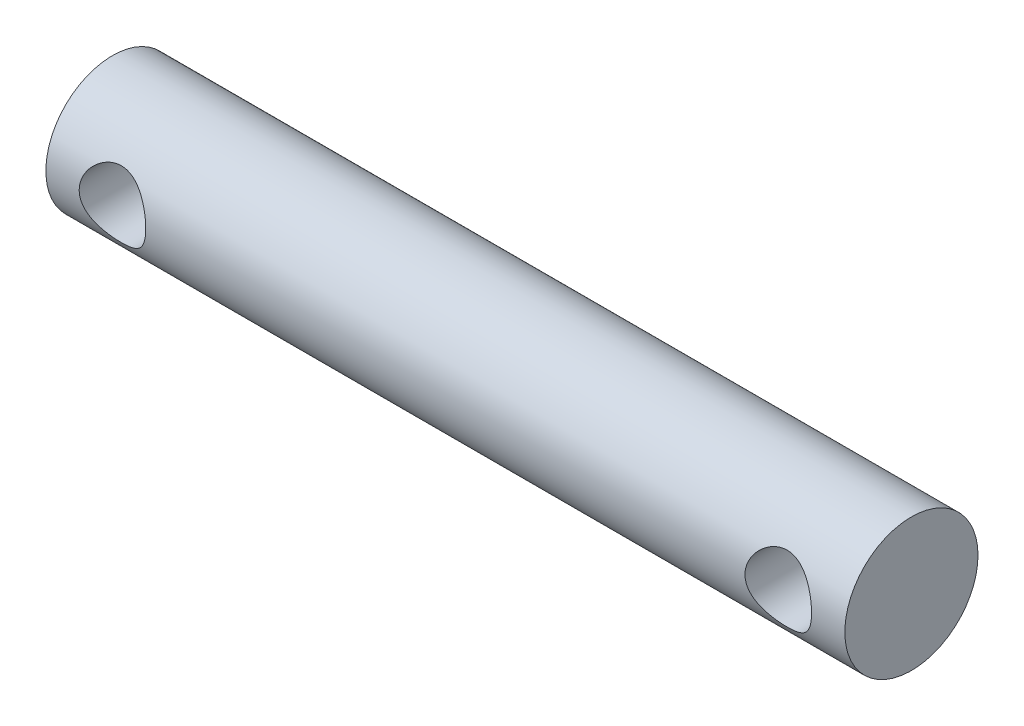
ISO-10303-21;
HEADER;
FILE_DESCRIPTION(('STEP AP214'),'2;1');
FILE_NAME('part.step','',(''),(''),'','','');
FILE_SCHEMA(('AUTOMOTIVE_DESIGN { 1 0 10303 214 1 1 1 1 }'));
ENDSEC;
DATA;
#1=APPLICATION_CONTEXT('core data for automotive mechanical design processes');
#2=APPLICATION_PROTOCOL_DEFINITION('international standard','automotive_design',2000,#1);
#3=PRODUCT_CONTEXT('',#1,'mechanical');
#4=PRODUCT('Part','Part','',(#3));
#5=PRODUCT_RELATED_PRODUCT_CATEGORY('part','',(#4));
#6=PRODUCT_DEFINITION_FORMATION('','',#4);
#7=PRODUCT_DEFINITION_CONTEXT('part definition',#1,'design');
#8=PRODUCT_DEFINITION('design','',#6,#7);
#9=PRODUCT_DEFINITION_SHAPE('','',#8);
#10=(LENGTH_UNIT() NAMED_UNIT(*) SI_UNIT(.MILLI.,.METRE.));
#11=(NAMED_UNIT(*) PLANE_ANGLE_UNIT() SI_UNIT($,.RADIAN.));
#12=(NAMED_UNIT(*) SI_UNIT($,.STERADIAN.) SOLID_ANGLE_UNIT());
#13=UNCERTAINTY_MEASURE_WITH_UNIT(LENGTH_MEASURE(1.E-05),#10,'distance_accuracy_value','');
#14=(GEOMETRIC_REPRESENTATION_CONTEXT(3) GLOBAL_UNCERTAINTY_ASSIGNED_CONTEXT((#13)) GLOBAL_UNIT_ASSIGNED_CONTEXT((#10,
#11,#12)) REPRESENTATION_CONTEXT('',''));
#15=CARTESIAN_POINT('',(0.,0.,0.));
#16=DIRECTION('',(0.,0.,1.));
#17=DIRECTION('',(1.,0.,0.));
#18=AXIS2_PLACEMENT_3D('',#15,#16,#17);
#19=CARTESIAN_POINT('',(36.,0.,0.));
#20=DIRECTION('',(-1.,0.,0.));
#21=DIRECTION('',(0.,0.,1.));
#22=AXIS2_PLACEMENT_3D('',#19,#20,#21);
#23=CYLINDRICAL_SURFACE('',#22,3.);
#24=CARTESIAN_POINT('',(4.5,0.,-3.));
#25=CARTESIAN_POINT('',(4.49999504652421,0.0788579444268501,-2.99999570107562));
#26=CARTESIAN_POINT('',(4.49374489031842,0.157809899546344,-2.99685736529635));
#27=CARTESIAN_POINT('',(4.46902067948769,0.313380352903344,-2.98461234055736));
#28=CARTESIAN_POINT('',(4.45052341050328,0.389994130070444,-2.97549431743379));
#29=CARTESIAN_POINT('',(4.40220928707506,0.538400317320673,-2.95224419105063));
#30=CARTESIAN_POINT('',(4.37243642362805,0.610210204408719,-2.93813158766306));
#31=CARTESIAN_POINT('',(4.30264406795253,0.747708925209898,-2.90618664773642));
#32=CARTESIAN_POINT('',(4.26262538362671,0.813398240985088,-2.88835460450288));
#33=CARTESIAN_POINT('',(4.17072412577207,0.941261726642863,-2.84934387387093));
#34=CARTESIAN_POINT('',(4.11827028114054,1.00298281668316,-2.82802798691306));
#35=CARTESIAN_POINT('',(4.00421778112945,1.11716916730047,-2.78489955370115));
#36=CARTESIAN_POINT('',(3.94261222234134,1.16962737466015,-2.76308664313552));
#37=CARTESIAN_POINT('',(3.80627497571493,1.26787800067542,-2.71948426796021));
#38=CARTESIAN_POINT('',(3.73089585248113,1.31283800332745,-2.69782780455198));
#39=CARTESIAN_POINT('',(3.57244899602068,1.38925234033604,-2.65928968158481));
#40=CARTESIAN_POINT('',(3.48938680691588,1.4207163224495,-2.64240461410484));
#41=CARTESIAN_POINT('',(3.32300234186712,1.46719866328288,-2.61686800556713));
#42=CARTESIAN_POINT('',(3.23999332189891,1.48308878562066,-2.6077840737557));
#43=CARTESIAN_POINT('',(3.07203174333079,1.50064048996327,-2.59772834922792));
#44=CARTESIAN_POINT('',(2.98708118869327,1.50231613255961,-2.59674854014932));
#45=CARTESIAN_POINT('',(2.82857096352695,1.49203093075844,-2.60266395385873));
#46=CARTESIAN_POINT('',(2.75486395316543,1.48167683930523,-2.6086314549302));
#47=CARTESIAN_POINT('',(2.61041713594044,1.4504097735854,-2.62614343100776));
#48=CARTESIAN_POINT('',(2.53967828204203,1.42949343584648,-2.63768968247664));
#49=CARTESIAN_POINT('',(2.40115630115151,1.37731467057901,-2.66531214619112));
#50=CARTESIAN_POINT('',(2.33348040182132,1.34582260067399,-2.68148760995998));
#51=CARTESIAN_POINT('',(2.20404856111499,1.273562531502,-2.71655106422106));
#52=CARTESIAN_POINT('',(2.14229529659987,1.2327903657187,-2.73544027170286));
#53=CARTESIAN_POINT('',(2.01821812088516,1.13709908236918,-2.77669736854929));
#54=CARTESIAN_POINT('',(1.95681468963577,1.08104168755392,-2.79920265355119));
#55=CARTESIAN_POINT('',(1.84389687211365,0.95933336811206,-2.84321434950611));
#56=CARTESIAN_POINT('',(1.79238721194918,0.893677884861428,-2.86472027938201));
#57=CARTESIAN_POINT('',(1.69847150845541,0.750774758747772,-2.90552980924446));
#58=CARTESIAN_POINT('',(1.65659929133139,0.673130387399113,-2.92468476243011));
#59=CARTESIAN_POINT('',(1.58685445643549,0.510699323233195,-2.95736821681863));
#60=CARTESIAN_POINT('',(1.55897072247725,0.425918364397914,-2.9709011841533));
#61=CARTESIAN_POINT('',(1.52028689442499,0.259149737491053,-2.98986500612153));
#62=CARTESIAN_POINT('',(1.50826314637983,0.177512295822489,-2.99587407451965));
#63=CARTESIAN_POINT('',(1.49780290329827,0.0131693999240276,-3.00109520188655));
#64=CARTESIAN_POINT('',(1.4993599715408,-0.0695355298048629,-3.00031048081978));
#65=CARTESIAN_POINT('',(1.51531003262812,-0.22684945797898,-2.99236788380152));
#66=CARTESIAN_POINT('',(1.52869879909499,-0.301589112074895,-2.98570868532253));
#67=CARTESIAN_POINT('',(1.56635710784269,-0.447610338452911,-2.9673325697226));
#68=CARTESIAN_POINT('',(1.59062784968024,-0.51889152853663,-2.95561509501618));
#69=CARTESIAN_POINT('',(1.64999769964955,-0.658332912674358,-2.92776377120382));
#70=CARTESIAN_POINT('',(1.68538657517443,-0.726345595508704,-2.91151322654446));
#71=CARTESIAN_POINT('',(1.76566130346985,-0.855692042548907,-2.87615961476126));
#72=CARTESIAN_POINT('',(1.8105512018931,-0.917022944664887,-2.85705533350407));
#73=CARTESIAN_POINT('',(1.91364063799608,-1.03765153393382,-2.81562332004297));
#74=CARTESIAN_POINT('',(1.97271430266772,-1.09615811672854,-2.79316327265249));
#75=CARTESIAN_POINT('',(2.09988772691659,-1.20278448167828,-2.7489358741323));
#76=CARTESIAN_POINT('',(2.16799367827188,-1.25089707856781,-2.72716901100071));
#77=CARTESIAN_POINT('',(2.31546548125947,-1.33756187171853,-2.68576788309734));
#78=CARTESIAN_POINT('',(2.39521689914173,-1.37553824370037,-2.66628794383591));
#79=CARTESIAN_POINT('',(2.56126510136245,-1.43712423890206,-2.63361108441202));
#80=CARTESIAN_POINT('',(2.64755328970034,-1.46075237380052,-2.62040607332625));
#81=CARTESIAN_POINT('',(2.81536533432706,-1.49079253120031,-2.60342251538703));
#82=CARTESIAN_POINT('',(2.89655138015286,-1.49863949460818,-2.59886075197597));
#83=CARTESIAN_POINT('',(3.05917060074679,-1.5010337315643,-2.59748031962405));
#84=CARTESIAN_POINT('',(3.14060365310679,-1.49558676993486,-2.60065829439585));
#85=CARTESIAN_POINT('',(3.29322525230016,-1.47288918838996,-2.61356793076615));
#86=CARTESIAN_POINT('',(3.36465070521711,-1.45681247151455,-2.62264641723988));
#87=CARTESIAN_POINT('',(3.50371217913655,-1.41476303733662,-2.64556524281479));
#88=CARTESIAN_POINT('',(3.57134697313805,-1.38878713673988,-2.65940711354503));
#89=CARTESIAN_POINT('',(3.70593727647981,-1.32572361795085,-2.69142795546804));
#90=CARTESIAN_POINT('',(3.77254185274355,-1.28800670672355,-2.70983583593881));
#91=CARTESIAN_POINT('',(3.89891180427189,-1.20322645745609,-2.74852997452291));
#92=CARTESIAN_POINT('',(3.95867359578167,-1.15615825686234,-2.76881720693416));
#93=CARTESIAN_POINT('',(4.07721297353201,-1.04730498999206,-2.81193484737138));
#94=CARTESIAN_POINT('',(4.13498865352544,-0.984426634495891,-2.83477474959942));
#95=CARTESIAN_POINT('',(4.23939447515291,-0.849232209349795,-2.87816628389896));
#96=CARTESIAN_POINT('',(4.28601860920486,-0.776911084957795,-2.89871667939293));
#97=CARTESIAN_POINT('',(4.36685454406811,-0.623897395174418,-2.93547014349806));
#98=CARTESIAN_POINT('',(4.4009762538547,-0.543149255665095,-2.95164144740899));
#99=CARTESIAN_POINT('',(4.45471225163612,-0.37611315170713,-2.9775201194848));
#100=CARTESIAN_POINT('',(4.47436777020857,-0.28984169938365,-2.98724585044602));
#101=CARTESIAN_POINT('',(4.49084611662861,-0.168902919736342,-2.99543192870217));
#102=CARTESIAN_POINT('',(4.49427396129951,-0.135242819162347,-2.99714048010376));
#103=CARTESIAN_POINT('',(4.49885199827113,-0.0677275977076368,-2.99942545465223));
#104=CARTESIAN_POINT('',(4.50000212770531,-0.0338724714699424,-3.00000184655071));
#105=CARTESIAN_POINT('',(4.5,0.,-3.));
#106=B_SPLINE_CURVE_WITH_KNOTS('',3,(#24,#25,#26,#27,#28,#29,#30,#31,#32,#33,#34,#35,#36,#37,
#38,#39,#40,#41,#42,#43,#44,#45,#46,#47,#48,#49,#50,#51,#52,#53,#54,#55,#56,#57,#58,#59,#60,#61,
#62,#63,#64,#65,#66,#67,#68,#69,#70,#71,#72,#73,#74,#75,#76,#77,#78,#79,#80,#81,#82,#83,#84,#85,
#86,#87,#88,#89,#90,#91,#92,#93,#94,#95,#96,#97,#98,#99,#100,#101,#102,#103,#104,#105),
.UNSPECIFIED.,.T.,.F.,(4,2,2,2,2,2,2,2,2,2,2,2,2,2,2,2,2,2,2,2,2,2,2,2,2,2,2,2,2,2,2,2,2,2,2,2,
2,2,2,2,4),(0.,0.236436386130439,0.473322224563796,0.709293233238447,0.945245640872351,
1.19547263807713,1.44588935648105,1.71572589646129,1.98536921847421,2.23887018210344,
2.4921203599353,2.71508568613981,2.93812205888518,3.16635360252731,3.39468781890332,
3.65197412000818,3.90938301898029,4.17874533321661,4.44789325368419,4.69474935707018,
4.94148846767214,5.16910359759183,5.39674382446397,5.63089284041848,5.86514176122509,
6.12239415966628,6.37982382923147,6.64972023242588,6.91926767918176,7.16293961254569,
7.40650589797017,7.62686895373283,7.84730293182526,8.08254685170431,8.31791341715446,
8.58187864135757,8.84598575071868,9.1119602049529,9.37717362931723,9.47872920200875,
9.58028757766598),.UNSPECIFIED.);
#107=CARTESIAN_POINT('',(4.5,0.,-3.));
#108=VERTEX_POINT('',#107);
#109=EDGE_CURVE('E10',#108,#108,#106,.T.);
#110=ORIENTED_EDGE('',*,*,#109,.T.);
#111=EDGE_LOOP('',(#110));
#112=FACE_BOUND('',#111,.T.);
#113=CARTESIAN_POINT('',(4.5,0.,3.));
#114=CARTESIAN_POINT('',(4.4999950465242,-0.0788579444268506,2.99999570107562));
#115=CARTESIAN_POINT('',(4.49374489031841,-0.157809899546344,2.99685736529635));
#116=CARTESIAN_POINT('',(4.4690206794877,-0.313380352903345,2.98461234055736));
#117=CARTESIAN_POINT('',(4.45052341050328,-0.389994130070444,2.97549431743379));
#118=CARTESIAN_POINT('',(4.40220928707506,-0.538400317320673,2.95224419105063));
#119=CARTESIAN_POINT('',(4.37243642362805,-0.610210204408719,2.93813158766306));
#120=CARTESIAN_POINT('',(4.30264406795253,-0.747708925209898,2.90618664773642));
#121=CARTESIAN_POINT('',(4.26262538362671,-0.813398240985088,2.88835460450288));
#122=CARTESIAN_POINT('',(4.17072412577207,-0.941261726642863,2.84934387387093));
#123=CARTESIAN_POINT('',(4.11827028114054,-1.00298281668316,2.82802798691306));
#124=CARTESIAN_POINT('',(4.00421778112945,-1.11716916730047,2.78489955370115));
#125=CARTESIAN_POINT('',(3.94261222234134,-1.16962737466015,2.76308664313552));
#126=CARTESIAN_POINT('',(3.80627497571493,-1.26787800067542,2.71948426796021));
#127=CARTESIAN_POINT('',(3.73089585248113,-1.31283800332745,2.69782780455198));
#128=CARTESIAN_POINT('',(3.57244899602068,-1.38925234033604,2.65928968158481));
#129=CARTESIAN_POINT('',(3.48938680691588,-1.4207163224495,2.64240461410484));
#130=CARTESIAN_POINT('',(3.32300234186712,-1.46719866328288,2.61686800556713));
#131=CARTESIAN_POINT('',(3.23999332189891,-1.48308878562066,2.6077840737557));
#132=CARTESIAN_POINT('',(3.07203174333079,-1.50064048996327,2.59772834922792));
#133=CARTESIAN_POINT('',(2.98708118869327,-1.50231613255961,2.59674854014932));
#134=CARTESIAN_POINT('',(2.82857096352695,-1.49203093075844,2.60266395385873));
#135=CARTESIAN_POINT('',(2.75486395316543,-1.48167683930523,2.6086314549302));
#136=CARTESIAN_POINT('',(2.61041713594044,-1.4504097735854,2.62614343100775));
#137=CARTESIAN_POINT('',(2.53967828204203,-1.42949343584648,2.63768968247664));
#138=CARTESIAN_POINT('',(2.40115630115151,-1.37731467057901,2.66531214619112));
#139=CARTESIAN_POINT('',(2.33348040182132,-1.34582260067399,2.68148760995998));
#140=CARTESIAN_POINT('',(2.20404856111499,-1.273562531502,2.71655106422106));
#141=CARTESIAN_POINT('',(2.14229529659987,-1.2327903657187,2.73544027170286));
#142=CARTESIAN_POINT('',(2.01821812088516,-1.13709908236918,2.77669736854929));
#143=CARTESIAN_POINT('',(1.95681468963577,-1.08104168755392,2.79920265355119));
#144=CARTESIAN_POINT('',(1.84389687211365,-0.95933336811206,2.84321434950611));
#145=CARTESIAN_POINT('',(1.79238721194918,-0.893677884861428,2.86472027938201));
#146=CARTESIAN_POINT('',(1.69847150845541,-0.750774758747773,2.90552980924446));
#147=CARTESIAN_POINT('',(1.65659929133139,-0.673130387399114,2.92468476243011));
#148=CARTESIAN_POINT('',(1.58685445643549,-0.510699323233196,2.95736821681863));
#149=CARTESIAN_POINT('',(1.55897072247725,-0.425918364397915,2.9709011841533));
#150=CARTESIAN_POINT('',(1.52028689442499,-0.259149737491054,2.98986500612153));
#151=CARTESIAN_POINT('',(1.50826314637983,-0.17751229582249,2.99587407451965));
#152=CARTESIAN_POINT('',(1.49780290329827,-0.0131693999240284,3.00109520188655));
#153=CARTESIAN_POINT('',(1.4993599715408,0.0695355298048622,3.00031048081978));
#154=CARTESIAN_POINT('',(1.51531003262812,0.226849457978979,2.99236788380152));
#155=CARTESIAN_POINT('',(1.52869879909499,0.301589112074894,2.98570868532253));
#156=CARTESIAN_POINT('',(1.56635710784269,0.447610338452911,2.9673325697226));
#157=CARTESIAN_POINT('',(1.59062784968024,0.51889152853663,2.95561509501618));
#158=CARTESIAN_POINT('',(1.64999769964955,0.658332912674358,2.92776377120382));
#159=CARTESIAN_POINT('',(1.68538657517443,0.726345595508704,2.91151322654446));
#160=CARTESIAN_POINT('',(1.76566130346985,0.855692042548907,2.87615961476126));
#161=CARTESIAN_POINT('',(1.8105512018931,0.917022944664886,2.85705533350407));
#162=CARTESIAN_POINT('',(1.91364063799608,1.03765153393382,2.81562332004297));
#163=CARTESIAN_POINT('',(1.97271430266772,1.09615811672854,2.79316327265249));
#164=CARTESIAN_POINT('',(2.09988772691659,1.20278448167828,2.7489358741323));
#165=CARTESIAN_POINT('',(2.16799367827188,1.25089707856781,2.72716901100071));
#166=CARTESIAN_POINT('',(2.31546548125947,1.33756187171853,2.68576788309734));
#167=CARTESIAN_POINT('',(2.39521689914173,1.37553824370037,2.66628794383591));
#168=CARTESIAN_POINT('',(2.56126510136245,1.43712423890206,2.63361108441202));
#169=CARTESIAN_POINT('',(2.64755328970034,1.46075237380052,2.62040607332625));
#170=CARTESIAN_POINT('',(2.81536533432706,1.49079253120031,2.60342251538703));
#171=CARTESIAN_POINT('',(2.89655138015287,1.49863949460818,2.59886075197597));
#172=CARTESIAN_POINT('',(3.05917060074679,1.5010337315643,2.59748031962405));
#173=CARTESIAN_POINT('',(3.14060365310679,1.49558676993486,2.60065829439585));
#174=CARTESIAN_POINT('',(3.29322525230016,1.47288918838996,2.61356793076615));
#175=CARTESIAN_POINT('',(3.36465070521711,1.45681247151455,2.62264641723988));
#176=CARTESIAN_POINT('',(3.50371217913655,1.41476303733662,2.64556524281479));
#177=CARTESIAN_POINT('',(3.57134697313805,1.38878713673988,2.65940711354503));
#178=CARTESIAN_POINT('',(3.70593727647981,1.32572361795085,2.69142795546804));
#179=CARTESIAN_POINT('',(3.77254185274354,1.28800670672355,2.70983583593881));
#180=CARTESIAN_POINT('',(3.89891180427189,1.20322645745609,2.74852997452291));
#181=CARTESIAN_POINT('',(3.95867359578167,1.15615825686234,2.76881720693416));
#182=CARTESIAN_POINT('',(4.07721297353201,1.04730498999206,2.81193484737138));
#183=CARTESIAN_POINT('',(4.13498865352544,0.984426634495892,2.83477474959942));
#184=CARTESIAN_POINT('',(4.23939447515291,0.849232209349796,2.87816628389896));
#185=CARTESIAN_POINT('',(4.28601860920486,0.776911084957796,2.89871667939293));
#186=CARTESIAN_POINT('',(4.36685454406811,0.623897395174419,2.93547014349806));
#187=CARTESIAN_POINT('',(4.4009762538547,0.543149255665096,2.95164144740899));
#188=CARTESIAN_POINT('',(4.45471225163612,0.37611315170713,2.9775201194848));
#189=CARTESIAN_POINT('',(4.47436777020857,0.28984169938365,2.98724585044602));
#190=CARTESIAN_POINT('',(4.49084611662862,0.168902919736343,2.99543192870217));
#191=CARTESIAN_POINT('',(4.49427396129951,0.135242819162347,2.99714048010376));
#192=CARTESIAN_POINT('',(4.49885199827113,0.0677275977076372,2.99942545465223));
#193=CARTESIAN_POINT('',(4.50000212770531,0.0338724714699426,3.00000184655071));
#194=CARTESIAN_POINT('',(4.5,0.,3.));
#195=B_SPLINE_CURVE_WITH_KNOTS('',3,(#113,#114,#115,#116,#117,#118,#119,#120,#121,#122,#123,
#124,#125,#126,#127,#128,#129,#130,#131,#132,#133,#134,#135,#136,#137,#138,#139,#140,#141,#142,
#143,#144,#145,#146,#147,#148,#149,#150,#151,#152,#153,#154,#155,#156,#157,#158,#159,#160,#161,
#162,#163,#164,#165,#166,#167,#168,#169,#170,#171,#172,#173,#174,#175,#176,#177,#178,#179,#180,
#181,#182,#183,#184,#185,#186,#187,#188,#189,#190,#191,#192,#193,#194),.UNSPECIFIED.,.T.,.F.,(4,
2,2,2,2,2,2,2,2,2,2,2,2,2,2,2,2,2,2,2,2,2,2,2,2,2,2,2,2,2,2,2,2,2,2,2,2,2,2,2,4),(0.,
0.236436386130439,0.473322224563796,0.709293233238446,0.94524564087235,1.19547263807713,
1.44588935648105,1.71572589646129,1.98536921847421,2.23887018210344,2.4921203599353,
2.71508568613981,2.93812205888517,3.16635360252731,3.39468781890332,3.65197412000817,
3.90938301898029,4.17874533321661,4.44789325368419,4.69474935707018,4.94148846767214,
5.16910359759183,5.39674382446397,5.63089284041848,5.86514176122509,6.12239415966628,
6.37982382923147,6.64972023242588,6.91926767918176,7.16293961254569,7.40650589797017,
7.62686895373283,7.84730293182526,8.0825468517043,8.31791341715446,8.58187864135757,
8.84598575071868,9.1119602049529,9.37717362931723,9.47872920200875,9.58028757766599),.UNSPECIFIED.);
#196=CARTESIAN_POINT('',(4.5,0.,3.));
#197=VERTEX_POINT('',#196);
#198=EDGE_CURVE('E45',#197,#197,#195,.T.);
#199=ORIENTED_EDGE('',*,*,#198,.T.);
#200=EDGE_LOOP('',(#199));
#201=FACE_BOUND('',#200,.T.);
#202=CARTESIAN_POINT('',(34.5,0.,-3.));
#203=CARTESIAN_POINT('',(34.4999950465242,0.0788579444268505,-2.99999570107562));
#204=CARTESIAN_POINT('',(34.4937448903184,0.157809899546344,-2.99685736529635));
#205=CARTESIAN_POINT('',(34.4690206794877,0.313380352903345,-2.98461234055736));
#206=CARTESIAN_POINT('',(34.4505234105033,0.389994130070445,-2.97549431743379));
#207=CARTESIAN_POINT('',(34.4022092870751,0.538400317320674,-2.95224419105063));
#208=CARTESIAN_POINT('',(34.3724364236281,0.610210204408719,-2.93813158766306));
#209=CARTESIAN_POINT('',(34.3026440679525,0.747708925209898,-2.90618664773642));
#210=CARTESIAN_POINT('',(34.2626253836267,0.81339824098509,-2.88835460450288));
#211=CARTESIAN_POINT('',(34.1707241257721,0.941261726642864,-2.84934387387093));
#212=CARTESIAN_POINT('',(34.1182702811405,1.00298281668316,-2.82802798691306));
#213=CARTESIAN_POINT('',(34.0042177811294,1.11716916730047,-2.78489955370115));
#214=CARTESIAN_POINT('',(33.9426122223413,1.16962737466015,-2.76308664313552));
#215=CARTESIAN_POINT('',(33.8062749757149,1.26787800067542,-2.71948426796021));
#216=CARTESIAN_POINT('',(33.7308958524811,1.31283800332746,-2.69782780455198));
#217=CARTESIAN_POINT('',(33.5724489960207,1.38925234033605,-2.65928968158481));
#218=CARTESIAN_POINT('',(33.4893868069159,1.4207163224495,-2.64240461410484));
#219=CARTESIAN_POINT('',(33.3230023418671,1.46719866328289,-2.61686800556713));
#220=CARTESIAN_POINT('',(33.2399933218989,1.48308878562067,-2.6077840737557));
#221=CARTESIAN_POINT('',(33.0720317433308,1.50064048996327,-2.59772834922791));
#222=CARTESIAN_POINT('',(32.9870811886933,1.50231613255961,-2.59674854014932));
#223=CARTESIAN_POINT('',(32.828570963527,1.49203093075845,-2.60266395385873));
#224=CARTESIAN_POINT('',(32.7548639531654,1.48167683930524,-2.6086314549302));
#225=CARTESIAN_POINT('',(32.6104171359404,1.4504097735854,-2.62614343100775));
#226=CARTESIAN_POINT('',(32.539678282042,1.42949343584648,-2.63768968247664));
#227=CARTESIAN_POINT('',(32.4011563011515,1.37731467057901,-2.66531214619111));
#228=CARTESIAN_POINT('',(32.3334804018213,1.34582260067399,-2.68148760995998));
#229=CARTESIAN_POINT('',(32.204048561115,1.27356253150201,-2.71655106422105));
#230=CARTESIAN_POINT('',(32.1422952965999,1.23279036571871,-2.73544027170286));
#231=CARTESIAN_POINT('',(32.0182181208852,1.13709908236919,-2.77669736854928));
#232=CARTESIAN_POINT('',(31.9568146896358,1.08104168755393,-2.79920265355119));
#233=CARTESIAN_POINT('',(31.8438968721136,0.959333368112066,-2.84321434950611));
#234=CARTESIAN_POINT('',(31.7923872119492,0.893677884861434,-2.86472027938201));
#235=CARTESIAN_POINT('',(31.6984715084554,0.750774758747778,-2.90552980924446));
#236=CARTESIAN_POINT('',(31.6565992913314,0.673130387399117,-2.92468476243011));
#237=CARTESIAN_POINT('',(31.5868544564355,0.510699323233196,-2.95736821681863));
#238=CARTESIAN_POINT('',(31.5589707224773,0.425918364397915,-2.9709011841533));
#239=CARTESIAN_POINT('',(31.520286894425,0.259149737491054,-2.98986500612153));
#240=CARTESIAN_POINT('',(31.5082631463798,0.17751229582249,-2.99587407451965));
#241=CARTESIAN_POINT('',(31.4978029032983,0.0131693999240292,-3.00109520188655));
#242=CARTESIAN_POINT('',(31.4993599715408,-0.0695355298048607,-3.00031048081978));
#243=CARTESIAN_POINT('',(31.5153100326281,-0.226849457978979,-2.99236788380152));
#244=CARTESIAN_POINT('',(31.528698799095,-0.301589112074895,-2.98570868532252));
#245=CARTESIAN_POINT('',(31.5663571078427,-0.447610338452912,-2.9673325697226));
#246=CARTESIAN_POINT('',(31.5906278496802,-0.518891528536631,-2.95561509501618));
#247=CARTESIAN_POINT('',(31.6499976996495,-0.658332912674357,-2.92776377120382));
#248=CARTESIAN_POINT('',(31.6853865751744,-0.7263455955087,-2.91151322654446));
#249=CARTESIAN_POINT('',(31.7656613034698,-0.855692042548903,-2.87615961476127));
#250=CARTESIAN_POINT('',(31.8105512018931,-0.917022944664886,-2.85705533350407));
#251=CARTESIAN_POINT('',(31.9136406379961,-1.03765153393382,-2.81562332004297));
#252=CARTESIAN_POINT('',(31.9727143026677,-1.09615811672854,-2.79316327265249));
#253=CARTESIAN_POINT('',(32.0998877269166,-1.20278448167829,-2.7489358741323));
#254=CARTESIAN_POINT('',(32.1679936782719,-1.25089707856781,-2.72716901100071));
#255=CARTESIAN_POINT('',(32.3154654812595,-1.33756187171853,-2.68576788309734));
#256=CARTESIAN_POINT('',(32.3952168991417,-1.37553824370037,-2.66628794383591));
#257=CARTESIAN_POINT('',(32.5612651013624,-1.43712423890206,-2.63361108441202));
#258=CARTESIAN_POINT('',(32.6475532897003,-1.46075237380053,-2.62040607332625));
#259=CARTESIAN_POINT('',(32.8153653343271,-1.49079253120031,-2.60342251538703));
#260=CARTESIAN_POINT('',(32.8965513801529,-1.49863949460818,-2.59886075197597));
#261=CARTESIAN_POINT('',(33.0591706007468,-1.50103373156431,-2.59748031962405));
#262=CARTESIAN_POINT('',(33.1406036531068,-1.49558676993487,-2.60065829439585));
#263=CARTESIAN_POINT('',(33.2932252523001,-1.47288918838997,-2.61356793076615));
#264=CARTESIAN_POINT('',(33.3646507052171,-1.45681247151455,-2.62264641723987));
#265=CARTESIAN_POINT('',(33.5037121791365,-1.41476303733662,-2.64556524281479));
#266=CARTESIAN_POINT('',(33.571346973138,-1.38878713673989,-2.65940711354503));
#267=CARTESIAN_POINT('',(33.7059372764798,-1.32572361795085,-2.69142795546803));
#268=CARTESIAN_POINT('',(33.7725418527435,-1.28800670672356,-2.70983583593881));
#269=CARTESIAN_POINT('',(33.8989118042719,-1.2032264574561,-2.7485299745229));
#270=CARTESIAN_POINT('',(33.9586735957817,-1.15615825686235,-2.76881720693416));
#271=CARTESIAN_POINT('',(34.077212973532,-1.04730498999207,-2.81193484737138));
#272=CARTESIAN_POINT('',(34.1349886535254,-0.984426634495899,-2.83477474959942));
#273=CARTESIAN_POINT('',(34.2393944751529,-0.849232209349803,-2.87816628389896));
#274=CARTESIAN_POINT('',(34.2860186092049,-0.776911084957804,-2.89871667939292));
#275=CARTESIAN_POINT('',(34.3668545440681,-0.623897395174428,-2.93547014349806));
#276=CARTESIAN_POINT('',(34.4009762538547,-0.543149255665106,-2.95164144740899));
#277=CARTESIAN_POINT('',(34.4547122516361,-0.376113151707138,-2.9775201194848));
#278=CARTESIAN_POINT('',(34.4743677702086,-0.289841699383656,-2.98724585044602));
#279=CARTESIAN_POINT('',(34.4908461166286,-0.168902919736347,-2.99543192870217));
#280=CARTESIAN_POINT('',(34.4942739612995,-0.135242819162351,-2.99714048010376));
#281=CARTESIAN_POINT('',(34.4988519982711,-0.0677275977076394,-2.99942545465223));
#282=CARTESIAN_POINT('',(34.5000021277053,-0.0338724714699437,-3.00000184655071));
#283=CARTESIAN_POINT('',(34.5,0.,-3.));
#284=B_SPLINE_CURVE_WITH_KNOTS('',3,(#202,#203,#204,#205,#206,#207,#208,#209,#210,#211,#212,
#213,#214,#215,#216,#217,#218,#219,#220,#221,#222,#223,#224,#225,#226,#227,#228,#229,#230,#231,
#232,#233,#234,#235,#236,#237,#238,#239,#240,#241,#242,#243,#244,#245,#246,#247,#248,#249,#250,
#251,#252,#253,#254,#255,#256,#257,#258,#259,#260,#261,#262,#263,#264,#265,#266,#267,#268,#269,
#270,#271,#272,#273,#274,#275,#276,#277,#278,#279,#280,#281,#282,#283),.UNSPECIFIED.,.T.,.F.,(4,
2,2,2,2,2,2,2,2,2,2,2,2,2,2,2,2,2,2,2,2,2,2,2,2,2,2,2,2,2,2,2,2,2,2,2,2,2,2,2,4),(0.,
0.236436386130439,0.473322224563797,0.709293233238445,0.945245640872351,1.19547263807713,
1.44588935648105,1.71572589646129,1.98536921847422,2.23887018210346,2.49212035993531,
2.71508568613981,2.93812205888519,3.16635360252732,3.39468781890333,3.65197412000819,
3.9093830189803,4.17874533321662,4.44789325368421,4.6947493570702,4.94148846767215,
5.16910359759184,5.39674382446398,5.63089284041849,5.86514176122511,6.1223941596663,
6.37982382923149,6.6497202324259,6.91926767918177,7.16293961254571,7.40650589797019,
7.62686895373286,7.84730293182529,8.08254685170432,8.31791341715448,8.58187864135759,
8.8459857507187,9.11196020495291,9.37717362931726,9.47872920200877,9.58028757766601),.UNSPECIFIED.);
#285=CARTESIAN_POINT('',(34.5,0.,-3.));
#286=VERTEX_POINT('',#285);
#287=EDGE_CURVE('E49',#286,#286,#284,.T.);
#288=ORIENTED_EDGE('',*,*,#287,.T.);
#289=EDGE_LOOP('',(#288));
#290=FACE_BOUND('',#289,.T.);
#291=CARTESIAN_POINT('',(34.5,0.,3.));
#292=CARTESIAN_POINT('',(34.4999950465242,-0.0788579444268505,2.99999570107562));
#293=CARTESIAN_POINT('',(34.4937448903184,-0.157809899546344,2.99685736529635));
#294=CARTESIAN_POINT('',(34.4690206794877,-0.313380352903345,2.98461234055736));
#295=CARTESIAN_POINT('',(34.4505234105033,-0.389994130070445,2.97549431743379));
#296=CARTESIAN_POINT('',(34.4022092870751,-0.538400317320674,2.95224419105063));
#297=CARTESIAN_POINT('',(34.3724364236281,-0.610210204408719,2.93813158766306));
#298=CARTESIAN_POINT('',(34.3026440679525,-0.747708925209898,2.90618664773642));
#299=CARTESIAN_POINT('',(34.2626253836267,-0.81339824098509,2.88835460450288));
#300=CARTESIAN_POINT('',(34.1707241257721,-0.941261726642864,2.84934387387093));
#301=CARTESIAN_POINT('',(34.1182702811405,-1.00298281668316,2.82802798691306));
#302=CARTESIAN_POINT('',(34.0042177811294,-1.11716916730047,2.78489955370115));
#303=CARTESIAN_POINT('',(33.9426122223413,-1.16962737466015,2.76308664313552));
#304=CARTESIAN_POINT('',(33.8062749757149,-1.26787800067542,2.71948426796021));
#305=CARTESIAN_POINT('',(33.7308958524811,-1.31283800332746,2.69782780455198));
#306=CARTESIAN_POINT('',(33.5724489960207,-1.38925234033605,2.65928968158481));
#307=CARTESIAN_POINT('',(33.4893868069159,-1.4207163224495,2.64240461410484));
#308=CARTESIAN_POINT('',(33.3230023418671,-1.46719866328289,2.61686800556713));
#309=CARTESIAN_POINT('',(33.2399933218989,-1.48308878562067,2.6077840737557));
#310=CARTESIAN_POINT('',(33.0720317433308,-1.50064048996327,2.59772834922791));
#311=CARTESIAN_POINT('',(32.9870811886933,-1.50231613255961,2.59674854014932));
#312=CARTESIAN_POINT('',(32.828570963527,-1.49203093075845,2.60266395385873));
#313=CARTESIAN_POINT('',(32.7548639531654,-1.48167683930524,2.6086314549302));
#314=CARTESIAN_POINT('',(32.6104171359404,-1.4504097735854,2.62614343100775));
#315=CARTESIAN_POINT('',(32.539678282042,-1.42949343584648,2.63768968247664));
#316=CARTESIAN_POINT('',(32.4011563011515,-1.37731467057901,2.66531214619111));
#317=CARTESIAN_POINT('',(32.3334804018213,-1.345822600674,2.68148760995998));
#318=CARTESIAN_POINT('',(32.204048561115,-1.27356253150201,2.71655106422105));
#319=CARTESIAN_POINT('',(32.1422952965999,-1.23279036571871,2.73544027170286));
#320=CARTESIAN_POINT('',(32.0182181208852,-1.13709908236919,2.77669736854928));
#321=CARTESIAN_POINT('',(31.9568146896358,-1.08104168755393,2.79920265355119));
#322=CARTESIAN_POINT('',(31.8438968721136,-0.959333368112066,2.84321434950611));
#323=CARTESIAN_POINT('',(31.7923872119492,-0.893677884861434,2.86472027938201));
#324=CARTESIAN_POINT('',(31.6984715084554,-0.750774758747778,2.90552980924446));
#325=CARTESIAN_POINT('',(31.6565992913314,-0.673130387399117,2.92468476243011));
#326=CARTESIAN_POINT('',(31.5868544564355,-0.510699323233197,2.95736821681863));
#327=CARTESIAN_POINT('',(31.5589707224773,-0.425918364397915,2.9709011841533));
#328=CARTESIAN_POINT('',(31.520286894425,-0.259149737491055,2.98986500612153));
#329=CARTESIAN_POINT('',(31.5082631463798,-0.177512295822491,2.99587407451965));
#330=CARTESIAN_POINT('',(31.4978029032983,-0.0131693999240298,3.00109520188655));
#331=CARTESIAN_POINT('',(31.4993599715408,0.0695355298048601,3.00031048081978));
#332=CARTESIAN_POINT('',(31.5153100326281,0.226849457978978,2.99236788380152));
#333=CARTESIAN_POINT('',(31.528698799095,0.301589112074894,2.98570868532253));
#334=CARTESIAN_POINT('',(31.5663571078427,0.447610338452911,2.9673325697226));
#335=CARTESIAN_POINT('',(31.5906278496802,0.51889152853663,2.95561509501618));
#336=CARTESIAN_POINT('',(31.6499976996495,0.658332912674356,2.92776377120382));
#337=CARTESIAN_POINT('',(31.6853865751744,0.7263455955087,2.91151322654446));
#338=CARTESIAN_POINT('',(31.7656613034698,0.855692042548903,2.87615961476127));
#339=CARTESIAN_POINT('',(31.8105512018931,0.917022944664887,2.85705533350407));
#340=CARTESIAN_POINT('',(31.9136406379961,1.03765153393383,2.81562332004297));
#341=CARTESIAN_POINT('',(31.9727143026677,1.09615811672854,2.79316327265249));
#342=CARTESIAN_POINT('',(32.0998877269166,1.20278448167829,2.7489358741323));
#343=CARTESIAN_POINT('',(32.1679936782719,1.25089707856781,2.72716901100071));
#344=CARTESIAN_POINT('',(32.3154654812595,1.33756187171853,2.68576788309734));
#345=CARTESIAN_POINT('',(32.3952168991417,1.37553824370037,2.66628794383591));
#346=CARTESIAN_POINT('',(32.5612651013624,1.43712423890206,2.63361108441202));
#347=CARTESIAN_POINT('',(32.6475532897003,1.46075237380053,2.62040607332625));
#348=CARTESIAN_POINT('',(32.8153653343271,1.49079253120031,2.60342251538703));
#349=CARTESIAN_POINT('',(32.8965513801529,1.49863949460818,2.59886075197597));
#350=CARTESIAN_POINT('',(33.0591706007468,1.50103373156431,2.59748031962405));
#351=CARTESIAN_POINT('',(33.1406036531068,1.49558676993487,2.60065829439585));
#352=CARTESIAN_POINT('',(33.2932252523001,1.47288918838997,2.61356793076615));
#353=CARTESIAN_POINT('',(33.3646507052171,1.45681247151456,2.62264641723987));
#354=CARTESIAN_POINT('',(33.5037121791365,1.41476303733662,2.64556524281479));
#355=CARTESIAN_POINT('',(33.571346973138,1.38878713673989,2.65940711354502));
#356=CARTESIAN_POINT('',(33.7059372764798,1.32572361795085,2.69142795546803));
#357=CARTESIAN_POINT('',(33.7725418527435,1.28800670672356,2.70983583593881));
#358=CARTESIAN_POINT('',(33.8989118042719,1.2032264574561,2.7485299745229));
#359=CARTESIAN_POINT('',(33.9586735957817,1.15615825686235,2.76881720693416));
#360=CARTESIAN_POINT('',(34.077212973532,1.04730498999207,2.81193484737138));
#361=CARTESIAN_POINT('',(34.1349886535254,0.9844266344959,2.83477474959942));
#362=CARTESIAN_POINT('',(34.2393944751529,0.849232209349804,2.87816628389896));
#363=CARTESIAN_POINT('',(34.2860186092049,0.776911084957805,2.89871667939292));
#364=CARTESIAN_POINT('',(34.3668545440681,0.623897395174428,2.93547014349806));
#365=CARTESIAN_POINT('',(34.4009762538547,0.543149255665105,2.95164144740899));
#366=CARTESIAN_POINT('',(34.4547122516361,0.376113151707137,2.9775201194848));
#367=CARTESIAN_POINT('',(34.4743677702086,0.289841699383656,2.98724585044602));
#368=CARTESIAN_POINT('',(34.4908461166286,0.168902919736348,2.99543192870217));
#369=CARTESIAN_POINT('',(34.4942739612995,0.135242819162352,2.99714048010376));
#370=CARTESIAN_POINT('',(34.4988519982711,0.0677275977076398,2.99942545465223));
#371=CARTESIAN_POINT('',(34.5000021277053,0.0338724714699439,3.00000184655071));
#372=CARTESIAN_POINT('',(34.5,0.,3.));
#373=B_SPLINE_CURVE_WITH_KNOTS('',3,(#291,#292,#293,#294,#295,#296,#297,#298,#299,#300,#301,
#302,#303,#304,#305,#306,#307,#308,#309,#310,#311,#312,#313,#314,#315,#316,#317,#318,#319,#320,
#321,#322,#323,#324,#325,#326,#327,#328,#329,#330,#331,#332,#333,#334,#335,#336,#337,#338,#339,
#340,#341,#342,#343,#344,#345,#346,#347,#348,#349,#350,#351,#352,#353,#354,#355,#356,#357,#358,
#359,#360,#361,#362,#363,#364,#365,#366,#367,#368,#369,#370,#371,#372),.UNSPECIFIED.,.T.,.F.,(4,
2,2,2,2,2,2,2,2,2,2,2,2,2,2,2,2,2,2,2,2,2,2,2,2,2,2,2,2,2,2,2,2,2,2,2,2,2,2,2,4),(0.,
0.236436386130439,0.473322224563797,0.709293233238445,0.945245640872351,1.19547263807713,
1.44588935648105,1.71572589646129,1.98536921847422,2.23887018210346,2.49212035993531,
2.71508568613981,2.93812205888519,3.16635360252731,3.39468781890333,3.65197412000819,
3.9093830189803,4.17874533321662,4.44789325368421,4.6947493570702,4.94148846767215,
5.16910359759184,5.39674382446399,5.63089284041849,5.8651417612251,6.1223941596663,
6.3798238292315,6.6497202324259,6.91926767918177,7.16293961254571,7.40650589797019,
7.62686895373285,7.84730293182528,8.08254685170432,8.31791341715448,8.58187864135758,
8.8459857507187,9.11196020495291,9.37717362931726,9.47872920200877,9.58028757766601),.UNSPECIFIED.);
#374=CARTESIAN_POINT('',(34.5,0.,3.));
#375=VERTEX_POINT('',#374);
#376=EDGE_CURVE('E53',#375,#375,#373,.T.);
#377=ORIENTED_EDGE('',*,*,#376,.T.);
#378=EDGE_LOOP('',(#377));
#379=FACE_BOUND('',#378,.T.);
#380=CARTESIAN_POINT('',(36.,0.,0.));
#381=DIRECTION('',(1.,0.,0.));
#382=DIRECTION('',(0.,0.,-1.));
#383=AXIS2_PLACEMENT_3D('',#380,#381,#382);
#384=CIRCLE('',#383,3.);
#385=CARTESIAN_POINT('',(36.,0.,-3.));
#386=VERTEX_POINT('',#385);
#387=EDGE_CURVE('E81',#386,#386,#384,.T.);
#388=ORIENTED_EDGE('',*,*,#387,.F.);
#389=EDGE_LOOP('',(#388));
#390=FACE_BOUND('',#389,.T.);
#391=CARTESIAN_POINT('',(0.,0.,0.));
#392=DIRECTION('',(1.,0.,0.));
#393=DIRECTION('',(0.,0.,-1.));
#394=AXIS2_PLACEMENT_3D('',#391,#392,#393);
#395=CIRCLE('',#394,3.);
#396=CARTESIAN_POINT('',(0.,0.,-3.));
#397=VERTEX_POINT('',#396);
#398=EDGE_CURVE('E82',#397,#397,#395,.T.);
#399=ORIENTED_EDGE('',*,*,#398,.T.);
#400=EDGE_LOOP('',(#399));
#401=FACE_BOUND('',#400,.T.);
#402=ADVANCED_FACE('F34',(#112,#201,#290,#379,#390,#401),#23,.T.);
#403=CARTESIAN_POINT('',(36.,0.,0.));
#404=DIRECTION('',(1.,0.,0.));
#405=DIRECTION('',(0.,0.,-1.));
#406=AXIS2_PLACEMENT_3D('',#403,#404,#405);
#407=PLANE('',#406);
#408=ORIENTED_EDGE('',*,*,#387,.T.);
#409=EDGE_LOOP('',(#408));
#410=FACE_BOUND('',#409,.T.);
#411=ADVANCED_FACE('F74',(#410),#407,.T.);
#412=CARTESIAN_POINT('',(0.,0.,0.));
#413=DIRECTION('',(1.,0.,0.));
#414=DIRECTION('',(0.,0.,-1.));
#415=AXIS2_PLACEMENT_3D('',#412,#413,#414);
#416=PLANE('',#415);
#417=ORIENTED_EDGE('',*,*,#398,.F.);
#418=EDGE_LOOP('',(#417));
#419=FACE_BOUND('',#418,.T.);
#420=ADVANCED_FACE('F72',(#419),#416,.F.);
#421=CARTESIAN_POINT('',(33.,0.,-3.));
#422=DIRECTION('',(0.,0.,1.));
#423=DIRECTION('',(1.,0.,0.));
#424=AXIS2_PLACEMENT_3D('',#421,#422,#423);
#425=CYLINDRICAL_SURFACE('',#424,1.5);
#426=ORIENTED_EDGE('',*,*,#287,.F.);
#427=EDGE_LOOP('',(#426));
#428=FACE_BOUND('',#427,.T.);
#429=ORIENTED_EDGE('',*,*,#376,.F.);
#430=EDGE_LOOP('',(#429));
#431=FACE_BOUND('',#430,.T.);
#432=ADVANCED_FACE('F66',(#428,#431),#425,.F.);
#433=CARTESIAN_POINT('',(3.,0.,-3.));
#434=DIRECTION('',(0.,0.,1.));
#435=DIRECTION('',(1.,0.,0.));
#436=AXIS2_PLACEMENT_3D('',#433,#434,#435);
#437=CYLINDRICAL_SURFACE('',#436,1.5);
#438=ORIENTED_EDGE('',*,*,#109,.F.);
#439=EDGE_LOOP('',(#438));
#440=FACE_BOUND('',#439,.T.);
#441=ORIENTED_EDGE('',*,*,#198,.F.);
#442=EDGE_LOOP('',(#441));
#443=FACE_BOUND('',#442,.T.);
#444=ADVANCED_FACE('F63',(#440,#443),#437,.F.);
#445=CLOSED_SHELL('',(#402,#411,#420,#432,#444));
#446=MANIFOLD_SOLID_BREP('B2',#445);
#447=ADVANCED_BREP_SHAPE_REPRESENTATION('',(#18,#446),#14);
#448=SHAPE_DEFINITION_REPRESENTATION(#9,#447);
ENDSEC;
END-ISO-10303-21;
